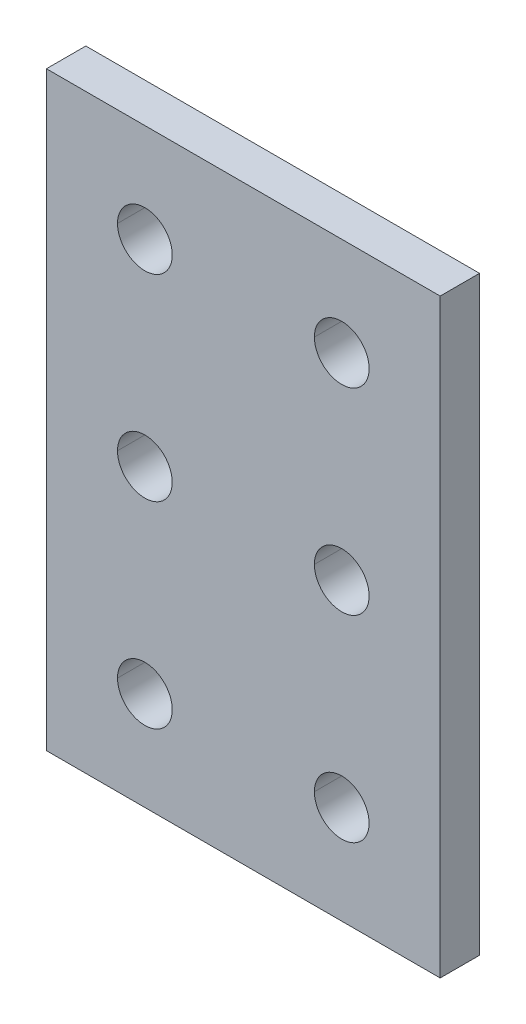
ISO-10303-21;
HEADER;
FILE_DESCRIPTION(('STEP AP214'),'2;1');
FILE_NAME('part.step','',(''),(''),'','','');
FILE_SCHEMA(('AUTOMOTIVE_DESIGN { 1 0 10303 214 1 1 1 1 }'));
ENDSEC;
DATA;
#1=APPLICATION_CONTEXT('core data for automotive mechanical design processes');
#2=APPLICATION_PROTOCOL_DEFINITION('international standard','automotive_design',2000,#1);
#3=PRODUCT_CONTEXT('',#1,'mechanical');
#4=PRODUCT('Part','Part','',(#3));
#5=PRODUCT_RELATED_PRODUCT_CATEGORY('part','',(#4));
#6=PRODUCT_DEFINITION_FORMATION('','',#4);
#7=PRODUCT_DEFINITION_CONTEXT('part definition',#1,'design');
#8=PRODUCT_DEFINITION('design','',#6,#7);
#9=PRODUCT_DEFINITION_SHAPE('','',#8);
#10=(LENGTH_UNIT() NAMED_UNIT(*) SI_UNIT(.MILLI.,.METRE.));
#11=(NAMED_UNIT(*) PLANE_ANGLE_UNIT() SI_UNIT($,.RADIAN.));
#12=(NAMED_UNIT(*) SI_UNIT($,.STERADIAN.) SOLID_ANGLE_UNIT());
#13=UNCERTAINTY_MEASURE_WITH_UNIT(LENGTH_MEASURE(1.E-05),#10,'distance_accuracy_value','');
#14=(GEOMETRIC_REPRESENTATION_CONTEXT(3) GLOBAL_UNCERTAINTY_ASSIGNED_CONTEXT((#13)) GLOBAL_UNIT_ASSIGNED_CONTEXT((#10,
#11,#12)) REPRESENTATION_CONTEXT('',''));
#15=CARTESIAN_POINT('',(0.,0.,0.));
#16=DIRECTION('',(0.,0.,1.));
#17=DIRECTION('',(1.,0.,0.));
#18=AXIS2_PLACEMENT_3D('',#15,#16,#17);
#19=CARTESIAN_POINT('',(20.,60.,4.));
#20=DIRECTION('',(0.,-1.,0.));
#21=DIRECTION('',(0.,0.,-1.));
#22=AXIS2_PLACEMENT_3D('',#19,#20,#21);
#23=PLANE('',#22);
#24=DIRECTION('',(-1.,0.,0.));
#25=VECTOR('',#24,1.);
#26=CARTESIAN_POINT('',(20.,60.,0.));
#27=LINE('',#26,#25);
#28=CARTESIAN_POINT('',(20.,60.,0.));
#29=VERTEX_POINT('',#28);
#30=CARTESIAN_POINT('',(-20.,60.,0.));
#31=VERTEX_POINT('',#30);
#32=EDGE_CURVE('E11',#29,#31,#27,.T.);
#33=ORIENTED_EDGE('',*,*,#32,.T.);
#34=DIRECTION('',(0.,0.,-1.));
#35=VECTOR('',#34,1.);
#36=CARTESIAN_POINT('',(-20.,60.,4.));
#37=LINE('',#36,#35);
#38=CARTESIAN_POINT('',(-20.,60.,4.));
#39=VERTEX_POINT('',#38);
#40=EDGE_CURVE('E26',#39,#31,#37,.T.);
#41=ORIENTED_EDGE('',*,*,#40,.F.);
#42=DIRECTION('',(-1.,0.,0.));
#43=VECTOR('',#42,1.);
#44=CARTESIAN_POINT('',(20.,60.,4.));
#45=LINE('',#44,#43);
#46=CARTESIAN_POINT('',(20.,60.,4.));
#47=VERTEX_POINT('',#46);
#48=EDGE_CURVE('E344',#47,#39,#45,.T.);
#49=ORIENTED_EDGE('',*,*,#48,.F.);
#50=DIRECTION('',(0.,0.,-1.));
#51=VECTOR('',#50,1.);
#52=CARTESIAN_POINT('',(20.,60.,4.));
#53=LINE('',#52,#51);
#54=EDGE_CURVE('E339',#47,#29,#53,.T.);
#55=ORIENTED_EDGE('',*,*,#54,.T.);
#56=EDGE_LOOP('',(#33,#41,#49,#55));
#57=FACE_BOUND('',#56,.T.);
#58=ADVANCED_FACE('F17',(#57),#23,.F.);
#59=CARTESIAN_POINT('',(20.,0.,4.));
#60=DIRECTION('',(-1.,0.,0.));
#61=DIRECTION('',(0.,0.,1.));
#62=AXIS2_PLACEMENT_3D('',#59,#60,#61);
#63=PLANE('',#62);
#64=DIRECTION('',(0.,1.,0.));
#65=VECTOR('',#64,1.);
#66=CARTESIAN_POINT('',(20.,0.,0.));
#67=LINE('',#66,#65);
#68=CARTESIAN_POINT('',(20.,0.,0.));
#69=VERTEX_POINT('',#68);
#70=EDGE_CURVE('E333',#69,#29,#67,.T.);
#71=ORIENTED_EDGE('',*,*,#70,.T.);
#72=ORIENTED_EDGE('',*,*,#54,.F.);
#73=DIRECTION('',(0.,1.,0.));
#74=VECTOR('',#73,1.);
#75=CARTESIAN_POINT('',(20.,0.,4.));
#76=LINE('',#75,#74);
#77=CARTESIAN_POINT('',(20.,0.,4.));
#78=VERTEX_POINT('',#77);
#79=EDGE_CURVE('E327',#78,#47,#76,.T.);
#80=ORIENTED_EDGE('',*,*,#79,.F.);
#81=DIRECTION('',(0.,0.,-1.));
#82=VECTOR('',#81,1.);
#83=CARTESIAN_POINT('',(20.,0.,4.));
#84=LINE('',#83,#82);
#85=EDGE_CURVE('E322',#78,#69,#84,.T.);
#86=ORIENTED_EDGE('',*,*,#85,.T.);
#87=EDGE_LOOP('',(#71,#72,#80,#86));
#88=FACE_BOUND('',#87,.T.);
#89=ADVANCED_FACE('F364',(#88),#63,.F.);
#90=CARTESIAN_POINT('',(-20.,0.,4.));
#91=DIRECTION('',(0.,1.,0.));
#92=DIRECTION('',(0.,0.,1.));
#93=AXIS2_PLACEMENT_3D('',#90,#91,#92);
#94=PLANE('',#93);
#95=DIRECTION('',(1.,0.,0.));
#96=VECTOR('',#95,1.);
#97=CARTESIAN_POINT('',(-20.,0.,0.));
#98=LINE('',#97,#96);
#99=CARTESIAN_POINT('',(-20.,0.,0.));
#100=VERTEX_POINT('',#99);
#101=EDGE_CURVE('E316',#100,#69,#98,.T.);
#102=ORIENTED_EDGE('',*,*,#101,.T.);
#103=ORIENTED_EDGE('',*,*,#85,.F.);
#104=DIRECTION('',(1.,0.,0.));
#105=VECTOR('',#104,1.);
#106=CARTESIAN_POINT('',(-20.,0.,4.));
#107=LINE('',#106,#105);
#108=CARTESIAN_POINT('',(-20.,0.,4.));
#109=VERTEX_POINT('',#108);
#110=EDGE_CURVE('E310',#109,#78,#107,.T.);
#111=ORIENTED_EDGE('',*,*,#110,.F.);
#112=DIRECTION('',(0.,0.,-1.));
#113=VECTOR('',#112,1.);
#114=CARTESIAN_POINT('',(-20.,0.,4.));
#115=LINE('',#114,#113);
#116=EDGE_CURVE('E305',#109,#100,#115,.T.);
#117=ORIENTED_EDGE('',*,*,#116,.T.);
#118=EDGE_LOOP('',(#102,#103,#111,#117));
#119=FACE_BOUND('',#118,.T.);
#120=ADVANCED_FACE('F368',(#119),#94,.F.);
#121=CARTESIAN_POINT('',(-20.,60.,4.));
#122=DIRECTION('',(1.,0.,0.));
#123=DIRECTION('',(0.,0.,-1.));
#124=AXIS2_PLACEMENT_3D('',#121,#122,#123);
#125=PLANE('',#124);
#126=DIRECTION('',(0.,-1.,0.));
#127=VECTOR('',#126,1.);
#128=CARTESIAN_POINT('',(-20.,60.,0.));
#129=LINE('',#128,#127);
#130=EDGE_CURVE('E299',#31,#100,#129,.T.);
#131=ORIENTED_EDGE('',*,*,#130,.T.);
#132=ORIENTED_EDGE('',*,*,#116,.F.);
#133=DIRECTION('',(0.,-1.,0.));
#134=VECTOR('',#133,1.);
#135=CARTESIAN_POINT('',(-20.,60.,4.));
#136=LINE('',#135,#134);
#137=EDGE_CURVE('E293',#39,#109,#136,.T.);
#138=ORIENTED_EDGE('',*,*,#137,.F.);
#139=ORIENTED_EDGE('',*,*,#40,.T.);
#140=EDGE_LOOP('',(#131,#132,#138,#139));
#141=FACE_BOUND('',#140,.T.);
#142=ADVANCED_FACE('F356',(#141),#125,.F.);
#143=CARTESIAN_POINT('',(0.,0.,4.));
#144=DIRECTION('',(0.,0.,1.));
#145=DIRECTION('',(1.,0.,0.));
#146=AXIS2_PLACEMENT_3D('',#143,#144,#145);
#147=PLANE('',#146);
#148=CARTESIAN_POINT('',(-10.,50.,4.));
#149=DIRECTION('',(0.,0.,1.));
#150=DIRECTION('',(1.,0.,0.));
#151=AXIS2_PLACEMENT_3D('',#148,#149,#150);
#152=CIRCLE('',#151,2.78);
#153=CARTESIAN_POINT('',(-12.78,50.,4.));
#154=VERTEX_POINT('',#153);
#155=CARTESIAN_POINT('',(-7.22,50.,4.));
#156=VERTEX_POINT('',#155);
#157=EDGE_CURVE('E287',#154,#156,#152,.T.);
#158=ORIENTED_EDGE('',*,*,#157,.F.);
#159=CARTESIAN_POINT('',(-10.,50.,4.));
#160=DIRECTION('',(0.,0.,1.));
#161=DIRECTION('',(1.,0.,0.));
#162=AXIS2_PLACEMENT_3D('',#159,#160,#161);
#163=CIRCLE('',#162,2.78);
#164=EDGE_CURVE('E281',#156,#154,#163,.T.);
#165=ORIENTED_EDGE('',*,*,#164,.F.);
#166=EDGE_LOOP('',(#158,#165));
#167=FACE_BOUND('',#166,.T.);
#168=CARTESIAN_POINT('',(-10.,30.,4.));
#169=DIRECTION('',(0.,0.,1.));
#170=DIRECTION('',(1.,0.,0.));
#171=AXIS2_PLACEMENT_3D('',#168,#169,#170);
#172=CIRCLE('',#171,2.78);
#173=CARTESIAN_POINT('',(-12.78,30.,4.));
#174=VERTEX_POINT('',#173);
#175=CARTESIAN_POINT('',(-7.22,30.,4.));
#176=VERTEX_POINT('',#175);
#177=EDGE_CURVE('E275',#174,#176,#172,.T.);
#178=ORIENTED_EDGE('',*,*,#177,.F.);
#179=CARTESIAN_POINT('',(-10.,30.,4.));
#180=DIRECTION('',(0.,0.,1.));
#181=DIRECTION('',(1.,0.,0.));
#182=AXIS2_PLACEMENT_3D('',#179,#180,#181);
#183=CIRCLE('',#182,2.78);
#184=EDGE_CURVE('E269',#176,#174,#183,.T.);
#185=ORIENTED_EDGE('',*,*,#184,.F.);
#186=EDGE_LOOP('',(#178,#185));
#187=FACE_BOUND('',#186,.T.);
#188=CARTESIAN_POINT('',(-10.,10.,4.));
#189=DIRECTION('',(0.,0.,1.));
#190=DIRECTION('',(1.,0.,0.));
#191=AXIS2_PLACEMENT_3D('',#188,#189,#190);
#192=CIRCLE('',#191,2.78);
#193=CARTESIAN_POINT('',(-12.78,10.,4.));
#194=VERTEX_POINT('',#193);
#195=CARTESIAN_POINT('',(-7.22,10.,4.));
#196=VERTEX_POINT('',#195);
#197=EDGE_CURVE('E263',#194,#196,#192,.T.);
#198=ORIENTED_EDGE('',*,*,#197,.F.);
#199=CARTESIAN_POINT('',(-10.,10.,4.));
#200=DIRECTION('',(0.,0.,1.));
#201=DIRECTION('',(1.,0.,0.));
#202=AXIS2_PLACEMENT_3D('',#199,#200,#201);
#203=CIRCLE('',#202,2.78);
#204=EDGE_CURVE('E257',#196,#194,#203,.T.);
#205=ORIENTED_EDGE('',*,*,#204,.F.);
#206=EDGE_LOOP('',(#198,#205));
#207=FACE_BOUND('',#206,.T.);
#208=CARTESIAN_POINT('',(10.,50.,4.));
#209=DIRECTION('',(0.,0.,1.));
#210=DIRECTION('',(1.,0.,0.));
#211=AXIS2_PLACEMENT_3D('',#208,#209,#210);
#212=CIRCLE('',#211,2.78);
#213=CARTESIAN_POINT('',(7.22,50.,4.));
#214=VERTEX_POINT('',#213);
#215=CARTESIAN_POINT('',(12.78,50.,4.));
#216=VERTEX_POINT('',#215);
#217=EDGE_CURVE('E251',#214,#216,#212,.T.);
#218=ORIENTED_EDGE('',*,*,#217,.F.);
#219=CARTESIAN_POINT('',(10.,50.,4.));
#220=DIRECTION('',(0.,0.,1.));
#221=DIRECTION('',(1.,0.,0.));
#222=AXIS2_PLACEMENT_3D('',#219,#220,#221);
#223=CIRCLE('',#222,2.78);
#224=EDGE_CURVE('E245',#216,#214,#223,.T.);
#225=ORIENTED_EDGE('',*,*,#224,.F.);
#226=EDGE_LOOP('',(#218,#225));
#227=FACE_BOUND('',#226,.T.);
#228=CARTESIAN_POINT('',(10.,30.,4.));
#229=DIRECTION('',(0.,0.,1.));
#230=DIRECTION('',(1.,0.,0.));
#231=AXIS2_PLACEMENT_3D('',#228,#229,#230);
#232=CIRCLE('',#231,2.78);
#233=CARTESIAN_POINT('',(7.22,30.,4.));
#234=VERTEX_POINT('',#233);
#235=CARTESIAN_POINT('',(12.78,30.,4.));
#236=VERTEX_POINT('',#235);
#237=EDGE_CURVE('E149',#234,#236,#232,.T.);
#238=ORIENTED_EDGE('',*,*,#237,.F.);
#239=CARTESIAN_POINT('',(10.,30.,4.));
#240=DIRECTION('',(0.,0.,1.));
#241=DIRECTION('',(1.,0.,0.));
#242=AXIS2_PLACEMENT_3D('',#239,#240,#241);
#243=CIRCLE('',#242,2.78);
#244=EDGE_CURVE('E236',#236,#234,#243,.T.);
#245=ORIENTED_EDGE('',*,*,#244,.F.);
#246=EDGE_LOOP('',(#238,#245));
#247=FACE_BOUND('',#246,.T.);
#248=CARTESIAN_POINT('',(10.,10.,4.));
#249=DIRECTION('',(0.,0.,1.));
#250=DIRECTION('',(1.,0.,0.));
#251=AXIS2_PLACEMENT_3D('',#248,#249,#250);
#252=CIRCLE('',#251,2.78);
#253=CARTESIAN_POINT('',(7.22,10.,4.));
#254=VERTEX_POINT('',#253);
#255=CARTESIAN_POINT('',(12.78,10.,4.));
#256=VERTEX_POINT('',#255);
#257=EDGE_CURVE('E230',#254,#256,#252,.T.);
#258=ORIENTED_EDGE('',*,*,#257,.F.);
#259=CARTESIAN_POINT('',(10.,10.,4.));
#260=DIRECTION('',(0.,0.,1.));
#261=DIRECTION('',(1.,0.,0.));
#262=AXIS2_PLACEMENT_3D('',#259,#260,#261);
#263=CIRCLE('',#262,2.78);
#264=EDGE_CURVE('E224',#256,#254,#263,.T.);
#265=ORIENTED_EDGE('',*,*,#264,.F.);
#266=EDGE_LOOP('',(#258,#265));
#267=FACE_BOUND('',#266,.T.);
#268=ORIENTED_EDGE('',*,*,#48,.T.);
#269=ORIENTED_EDGE('',*,*,#137,.T.);
#270=ORIENTED_EDGE('',*,*,#110,.T.);
#271=ORIENTED_EDGE('',*,*,#79,.T.);
#272=EDGE_LOOP('',(#268,#269,#270,#271));
#273=FACE_BOUND('',#272,.T.);
#274=ADVANCED_FACE('F360',(#167,#187,#207,#227,#247,#267,#273),#147,.T.);
#275=CARTESIAN_POINT('',(10.,10.,4.));
#276=DIRECTION('',(0.,0.,-1.));
#277=DIRECTION('',(0.,-1.,0.));
#278=AXIS2_PLACEMENT_3D('',#275,#276,#277);
#279=CYLINDRICAL_SURFACE('',#278,2.78);
#280=DIRECTION('',(0.,0.,-1.));
#281=VECTOR('',#280,1.);
#282=CARTESIAN_POINT('',(12.78,10.,4.));
#283=LINE('',#282,#281);
#284=CARTESIAN_POINT('',(12.78,10.,0.));
#285=VERTEX_POINT('',#284);
#286=EDGE_CURVE('E218',#256,#285,#283,.T.);
#287=ORIENTED_EDGE('',*,*,#286,.F.);
#288=ORIENTED_EDGE('',*,*,#264,.T.);
#289=DIRECTION('',(0.,0.,-1.));
#290=VECTOR('',#289,1.);
#291=CARTESIAN_POINT('',(7.22,10.,4.));
#292=LINE('',#291,#290);
#293=CARTESIAN_POINT('',(7.22,10.,0.));
#294=VERTEX_POINT('',#293);
#295=EDGE_CURVE('E213',#254,#294,#292,.T.);
#296=ORIENTED_EDGE('',*,*,#295,.T.);
#297=CARTESIAN_POINT('',(10.,10.,0.));
#298=DIRECTION('',(0.,0.,1.));
#299=DIRECTION('',(1.,0.,0.));
#300=AXIS2_PLACEMENT_3D('',#297,#298,#299);
#301=CIRCLE('',#300,2.78);
#302=EDGE_CURVE('E207',#285,#294,#301,.T.);
#303=ORIENTED_EDGE('',*,*,#302,.F.);
#304=EDGE_LOOP('',(#287,#288,#296,#303));
#305=FACE_BOUND('',#304,.T.);
#306=ADVANCED_FACE('F411',(#305),#279,.F.);
#307=CARTESIAN_POINT('',(0.,0.,0.));
#308=DIRECTION('',(0.,0.,1.));
#309=DIRECTION('',(1.,0.,0.));
#310=AXIS2_PLACEMENT_3D('',#307,#308,#309);
#311=PLANE('',#310);
#312=CARTESIAN_POINT('',(-10.,50.,0.));
#313=DIRECTION('',(0.,0.,1.));
#314=DIRECTION('',(1.,0.,0.));
#315=AXIS2_PLACEMENT_3D('',#312,#313,#314);
#316=CIRCLE('',#315,2.78);
#317=CARTESIAN_POINT('',(-7.22,50.,0.));
#318=VERTEX_POINT('',#317);
#319=CARTESIAN_POINT('',(-12.78,50.,0.));
#320=VERTEX_POINT('',#319);
#321=EDGE_CURVE('E202',#318,#320,#316,.T.);
#322=ORIENTED_EDGE('',*,*,#321,.T.);
#323=CARTESIAN_POINT('',(-10.,50.,0.));
#324=DIRECTION('',(0.,0.,1.));
#325=DIRECTION('',(1.,0.,0.));
#326=AXIS2_PLACEMENT_3D('',#323,#324,#325);
#327=CIRCLE('',#326,2.78);
#328=EDGE_CURVE('E197',#320,#318,#327,.T.);
#329=ORIENTED_EDGE('',*,*,#328,.T.);
#330=EDGE_LOOP('',(#322,#329));
#331=FACE_BOUND('',#330,.T.);
#332=CARTESIAN_POINT('',(-10.,30.,0.));
#333=DIRECTION('',(0.,0.,1.));
#334=DIRECTION('',(1.,0.,0.));
#335=AXIS2_PLACEMENT_3D('',#332,#333,#334);
#336=CIRCLE('',#335,2.78);
#337=CARTESIAN_POINT('',(-7.22,30.,0.));
#338=VERTEX_POINT('',#337);
#339=CARTESIAN_POINT('',(-12.78,30.,0.));
#340=VERTEX_POINT('',#339);
#341=EDGE_CURVE('E192',#338,#340,#336,.T.);
#342=ORIENTED_EDGE('',*,*,#341,.T.);
#343=CARTESIAN_POINT('',(-10.,30.,0.));
#344=DIRECTION('',(0.,0.,1.));
#345=DIRECTION('',(1.,0.,0.));
#346=AXIS2_PLACEMENT_3D('',#343,#344,#345);
#347=CIRCLE('',#346,2.78);
#348=EDGE_CURVE('E187',#340,#338,#347,.T.);
#349=ORIENTED_EDGE('',*,*,#348,.T.);
#350=EDGE_LOOP('',(#342,#349));
#351=FACE_BOUND('',#350,.T.);
#352=CARTESIAN_POINT('',(-10.,10.,0.));
#353=DIRECTION('',(0.,0.,1.));
#354=DIRECTION('',(1.,0.,0.));
#355=AXIS2_PLACEMENT_3D('',#352,#353,#354);
#356=CIRCLE('',#355,2.78);
#357=CARTESIAN_POINT('',(-7.22,10.,0.));
#358=VERTEX_POINT('',#357);
#359=CARTESIAN_POINT('',(-12.78,10.,0.));
#360=VERTEX_POINT('',#359);
#361=EDGE_CURVE('E182',#358,#360,#356,.T.);
#362=ORIENTED_EDGE('',*,*,#361,.T.);
#363=CARTESIAN_POINT('',(-10.,10.,0.));
#364=DIRECTION('',(0.,0.,1.));
#365=DIRECTION('',(1.,0.,0.));
#366=AXIS2_PLACEMENT_3D('',#363,#364,#365);
#367=CIRCLE('',#366,2.78);
#368=EDGE_CURVE('E177',#360,#358,#367,.T.);
#369=ORIENTED_EDGE('',*,*,#368,.T.);
#370=EDGE_LOOP('',(#362,#369));
#371=FACE_BOUND('',#370,.T.);
#372=CARTESIAN_POINT('',(10.,50.,0.));
#373=DIRECTION('',(0.,0.,1.));
#374=DIRECTION('',(1.,0.,0.));
#375=AXIS2_PLACEMENT_3D('',#372,#373,#374);
#376=CIRCLE('',#375,2.78);
#377=CARTESIAN_POINT('',(12.78,50.,0.));
#378=VERTEX_POINT('',#377);
#379=CARTESIAN_POINT('',(7.22,50.,0.));
#380=VERTEX_POINT('',#379);
#381=EDGE_CURVE('E172',#378,#380,#376,.T.);
#382=ORIENTED_EDGE('',*,*,#381,.T.);
#383=CARTESIAN_POINT('',(10.,50.,0.));
#384=DIRECTION('',(0.,0.,1.));
#385=DIRECTION('',(1.,0.,0.));
#386=AXIS2_PLACEMENT_3D('',#383,#384,#385);
#387=CIRCLE('',#386,2.78);
#388=EDGE_CURVE('E146',#380,#378,#387,.T.);
#389=ORIENTED_EDGE('',*,*,#388,.T.);
#390=EDGE_LOOP('',(#382,#389));
#391=FACE_BOUND('',#390,.T.);
#392=CARTESIAN_POINT('',(10.,30.,0.));
#393=DIRECTION('',(0.,0.,1.));
#394=DIRECTION('',(1.,0.,0.));
#395=AXIS2_PLACEMENT_3D('',#392,#393,#394);
#396=CIRCLE('',#395,2.78);
#397=CARTESIAN_POINT('',(12.78,30.,0.));
#398=VERTEX_POINT('',#397);
#399=CARTESIAN_POINT('',(7.22,30.,0.));
#400=VERTEX_POINT('',#399);
#401=EDGE_CURVE('E130',#398,#400,#396,.T.);
#402=ORIENTED_EDGE('',*,*,#401,.T.);
#403=CARTESIAN_POINT('',(10.,30.,0.));
#404=DIRECTION('',(0.,0.,1.));
#405=DIRECTION('',(1.,0.,0.));
#406=AXIS2_PLACEMENT_3D('',#403,#404,#405);
#407=CIRCLE('',#406,2.78);
#408=EDGE_CURVE('E126',#400,#398,#407,.T.);
#409=ORIENTED_EDGE('',*,*,#408,.T.);
#410=EDGE_LOOP('',(#402,#409));
#411=FACE_BOUND('',#410,.T.);
#412=ORIENTED_EDGE('',*,*,#302,.T.);
#413=CARTESIAN_POINT('',(10.,10.,0.));
#414=DIRECTION('',(0.,0.,1.));
#415=DIRECTION('',(1.,0.,0.));
#416=AXIS2_PLACEMENT_3D('',#413,#414,#415);
#417=CIRCLE('',#416,2.78);
#418=EDGE_CURVE('E136',#294,#285,#417,.T.);
#419=ORIENTED_EDGE('',*,*,#418,.T.);
#420=EDGE_LOOP('',(#412,#419));
#421=FACE_BOUND('',#420,.T.);
#422=ORIENTED_EDGE('',*,*,#32,.F.);
#423=ORIENTED_EDGE('',*,*,#70,.F.);
#424=ORIENTED_EDGE('',*,*,#101,.F.);
#425=ORIENTED_EDGE('',*,*,#130,.F.);
#426=EDGE_LOOP('',(#422,#423,#424,#425));
#427=FACE_BOUND('',#426,.T.);
#428=ADVANCED_FACE('F128',(#331,#351,#371,#391,#411,#421,#427),#311,.F.);
#429=CARTESIAN_POINT('',(10.,10.,4.));
#430=DIRECTION('',(0.,0.,-1.));
#431=DIRECTION('',(0.,1.,0.));
#432=AXIS2_PLACEMENT_3D('',#429,#430,#431);
#433=CYLINDRICAL_SURFACE('',#432,2.78);
#434=ORIENTED_EDGE('',*,*,#286,.T.);
#435=ORIENTED_EDGE('',*,*,#418,.F.);
#436=ORIENTED_EDGE('',*,*,#295,.F.);
#437=ORIENTED_EDGE('',*,*,#257,.T.);
#438=EDGE_LOOP('',(#434,#435,#436,#437));
#439=FACE_BOUND('',#438,.T.);
#440=ADVANCED_FACE('F432',(#439),#433,.F.);
#441=CARTESIAN_POINT('',(10.,30.,4.));
#442=DIRECTION('',(0.,0.,-1.));
#443=DIRECTION('',(0.,1.,0.));
#444=AXIS2_PLACEMENT_3D('',#441,#442,#443);
#445=CYLINDRICAL_SURFACE('',#444,2.78);
#446=DIRECTION('',(0.,0.,-1.));
#447=VECTOR('',#446,1.);
#448=CARTESIAN_POINT('',(12.78,30.,4.));
#449=LINE('',#448,#447);
#450=EDGE_CURVE('E142',#236,#398,#449,.T.);
#451=ORIENTED_EDGE('',*,*,#450,.T.);
#452=ORIENTED_EDGE('',*,*,#408,.F.);
#453=DIRECTION('',(0.,0.,-1.));
#454=VECTOR('',#453,1.);
#455=CARTESIAN_POINT('',(7.22,30.,4.));
#456=LINE('',#455,#454);
#457=EDGE_CURVE('E144',#234,#400,#456,.T.);
#458=ORIENTED_EDGE('',*,*,#457,.F.);
#459=ORIENTED_EDGE('',*,*,#237,.T.);
#460=EDGE_LOOP('',(#451,#452,#458,#459));
#461=FACE_BOUND('',#460,.T.);
#462=ADVANCED_FACE('F148',(#461),#445,.F.);
#463=CARTESIAN_POINT('',(10.,30.,4.));
#464=DIRECTION('',(0.,0.,-1.));
#465=DIRECTION('',(0.,-1.,0.));
#466=AXIS2_PLACEMENT_3D('',#463,#464,#465);
#467=CYLINDRICAL_SURFACE('',#466,2.78);
#468=ORIENTED_EDGE('',*,*,#450,.F.);
#469=ORIENTED_EDGE('',*,*,#244,.T.);
#470=ORIENTED_EDGE('',*,*,#457,.T.);
#471=ORIENTED_EDGE('',*,*,#401,.F.);
#472=EDGE_LOOP('',(#468,#469,#470,#471));
#473=FACE_BOUND('',#472,.T.);
#474=ADVANCED_FACE('F140',(#473),#467,.F.);
#475=CARTESIAN_POINT('',(10.,50.,4.));
#476=DIRECTION('',(0.,0.,-1.));
#477=DIRECTION('',(0.,1.,0.));
#478=AXIS2_PLACEMENT_3D('',#475,#476,#477);
#479=CYLINDRICAL_SURFACE('',#478,2.78);
#480=DIRECTION('',(0.,0.,-1.));
#481=VECTOR('',#480,1.);
#482=CARTESIAN_POINT('',(12.78,50.,4.));
#483=LINE('',#482,#481);
#484=EDGE_CURVE('E157',#216,#378,#483,.T.);
#485=ORIENTED_EDGE('',*,*,#484,.T.);
#486=ORIENTED_EDGE('',*,*,#388,.F.);
#487=DIRECTION('',(0.,0.,-1.));
#488=VECTOR('',#487,1.);
#489=CARTESIAN_POINT('',(7.22,50.,4.));
#490=LINE('',#489,#488);
#491=EDGE_CURVE('E605',#214,#380,#490,.T.);
#492=ORIENTED_EDGE('',*,*,#491,.F.);
#493=ORIENTED_EDGE('',*,*,#217,.T.);
#494=EDGE_LOOP('',(#485,#486,#492,#493));
#495=FACE_BOUND('',#494,.T.);
#496=ADVANCED_FACE('F462',(#495),#479,.F.);
#497=CARTESIAN_POINT('',(10.,50.,4.));
#498=DIRECTION('',(0.,0.,-1.));
#499=DIRECTION('',(0.,-1.,0.));
#500=AXIS2_PLACEMENT_3D('',#497,#498,#499);
#501=CYLINDRICAL_SURFACE('',#500,2.78);
#502=ORIENTED_EDGE('',*,*,#484,.F.);
#503=ORIENTED_EDGE('',*,*,#224,.T.);
#504=ORIENTED_EDGE('',*,*,#491,.T.);
#505=ORIENTED_EDGE('',*,*,#381,.F.);
#506=EDGE_LOOP('',(#502,#503,#504,#505));
#507=FACE_BOUND('',#506,.T.);
#508=ADVANCED_FACE('F472',(#507),#501,.F.);
#509=CARTESIAN_POINT('',(-10.,10.,4.));
#510=DIRECTION('',(0.,0.,-1.));
#511=DIRECTION('',(0.,1.,0.));
#512=AXIS2_PLACEMENT_3D('',#509,#510,#511);
#513=CYLINDRICAL_SURFACE('',#512,2.78);
#514=DIRECTION('',(0.,0.,-1.));
#515=VECTOR('',#514,1.);
#516=CARTESIAN_POINT('',(-7.22,10.,4.));
#517=LINE('',#516,#515);
#518=EDGE_CURVE('E608',#196,#358,#517,.T.);
#519=ORIENTED_EDGE('',*,*,#518,.T.);
#520=ORIENTED_EDGE('',*,*,#368,.F.);
#521=DIRECTION('',(0.,0.,-1.));
#522=VECTOR('',#521,1.);
#523=CARTESIAN_POINT('',(-12.78,10.,4.));
#524=LINE('',#523,#522);
#525=EDGE_CURVE('E622',#194,#360,#524,.T.);
#526=ORIENTED_EDGE('',*,*,#525,.F.);
#527=ORIENTED_EDGE('',*,*,#197,.T.);
#528=EDGE_LOOP('',(#519,#520,#526,#527));
#529=FACE_BOUND('',#528,.T.);
#530=ADVANCED_FACE('F483',(#529),#513,.F.);
#531=CARTESIAN_POINT('',(-10.,10.,4.));
#532=DIRECTION('',(0.,0.,-1.));
#533=DIRECTION('',(0.,-1.,0.));
#534=AXIS2_PLACEMENT_3D('',#531,#532,#533);
#535=CYLINDRICAL_SURFACE('',#534,2.78);
#536=ORIENTED_EDGE('',*,*,#518,.F.);
#537=ORIENTED_EDGE('',*,*,#204,.T.);
#538=ORIENTED_EDGE('',*,*,#525,.T.);
#539=ORIENTED_EDGE('',*,*,#361,.F.);
#540=EDGE_LOOP('',(#536,#537,#538,#539));
#541=FACE_BOUND('',#540,.T.);
#542=ADVANCED_FACE('F494',(#541),#535,.F.);
#543=CARTESIAN_POINT('',(-10.,30.,4.));
#544=DIRECTION('',(0.,0.,-1.));
#545=DIRECTION('',(0.,1.,0.));
#546=AXIS2_PLACEMENT_3D('',#543,#544,#545);
#547=CYLINDRICAL_SURFACE('',#546,2.78);
#548=DIRECTION('',(0.,0.,-1.));
#549=VECTOR('',#548,1.);
#550=CARTESIAN_POINT('',(-7.22,30.,4.));
#551=LINE('',#550,#549);
#552=EDGE_CURVE('E628',#176,#338,#551,.T.);
#553=ORIENTED_EDGE('',*,*,#552,.T.);
#554=ORIENTED_EDGE('',*,*,#348,.F.);
#555=DIRECTION('',(0.,0.,-1.));
#556=VECTOR('',#555,1.);
#557=CARTESIAN_POINT('',(-12.78,30.,4.));
#558=LINE('',#557,#556);
#559=EDGE_CURVE('E586',#174,#340,#558,.T.);
#560=ORIENTED_EDGE('',*,*,#559,.F.);
#561=ORIENTED_EDGE('',*,*,#177,.T.);
#562=EDGE_LOOP('',(#553,#554,#560,#561));
#563=FACE_BOUND('',#562,.T.);
#564=ADVANCED_FACE('F505',(#563),#547,.F.);
#565=CARTESIAN_POINT('',(-10.,30.,4.));
#566=DIRECTION('',(0.,0.,-1.));
#567=DIRECTION('',(0.,-1.,0.));
#568=AXIS2_PLACEMENT_3D('',#565,#566,#567);
#569=CYLINDRICAL_SURFACE('',#568,2.78);
#570=ORIENTED_EDGE('',*,*,#552,.F.);
#571=ORIENTED_EDGE('',*,*,#184,.T.);
#572=ORIENTED_EDGE('',*,*,#559,.T.);
#573=ORIENTED_EDGE('',*,*,#341,.F.);
#574=EDGE_LOOP('',(#570,#571,#572,#573));
#575=FACE_BOUND('',#574,.T.);
#576=ADVANCED_FACE('F516',(#575),#569,.F.);
#577=CARTESIAN_POINT('',(-10.,50.,4.));
#578=DIRECTION('',(0.,0.,-1.));
#579=DIRECTION('',(0.,1.,0.));
#580=AXIS2_PLACEMENT_3D('',#577,#578,#579);
#581=CYLINDRICAL_SURFACE('',#580,2.78);
#582=DIRECTION('',(0.,0.,-1.));
#583=VECTOR('',#582,1.);
#584=CARTESIAN_POINT('',(-7.22,50.,4.));
#585=LINE('',#584,#583);
#586=EDGE_CURVE('E582',#156,#318,#585,.T.);
#587=ORIENTED_EDGE('',*,*,#586,.T.);
#588=ORIENTED_EDGE('',*,*,#328,.F.);
#589=DIRECTION('',(0.,0.,-1.));
#590=VECTOR('',#589,1.);
#591=CARTESIAN_POINT('',(-12.78,50.,4.));
#592=LINE('',#591,#590);
#593=EDGE_CURVE('E587',#154,#320,#592,.T.);
#594=ORIENTED_EDGE('',*,*,#593,.F.);
#595=ORIENTED_EDGE('',*,*,#157,.T.);
#596=EDGE_LOOP('',(#587,#588,#594,#595));
#597=FACE_BOUND('',#596,.T.);
#598=ADVANCED_FACE('F527',(#597),#581,.F.);
#599=CARTESIAN_POINT('',(-10.,50.,4.));
#600=DIRECTION('',(0.,0.,-1.));
#601=DIRECTION('',(0.,-1.,0.));
#602=AXIS2_PLACEMENT_3D('',#599,#600,#601);
#603=CYLINDRICAL_SURFACE('',#602,2.78);
#604=ORIENTED_EDGE('',*,*,#586,.F.);
#605=ORIENTED_EDGE('',*,*,#164,.T.);
#606=ORIENTED_EDGE('',*,*,#593,.T.);
#607=ORIENTED_EDGE('',*,*,#321,.F.);
#608=EDGE_LOOP('',(#604,#605,#606,#607));
#609=FACE_BOUND('',#608,.T.);
#610=ADVANCED_FACE('F538',(#609),#603,.F.);
#611=CLOSED_SHELL('',(#58,#89,#120,#142,#274,#306,#428,#440,#462,#474,#496,#508,#530,#542,#564,
#576,#598,#610));
#612=MANIFOLD_SOLID_BREP('B1',#611);
#613=ADVANCED_BREP_SHAPE_REPRESENTATION('',(#18,#612),#14);
#614=SHAPE_DEFINITION_REPRESENTATION(#9,#613);
ENDSEC;
END-ISO-10303-21;
